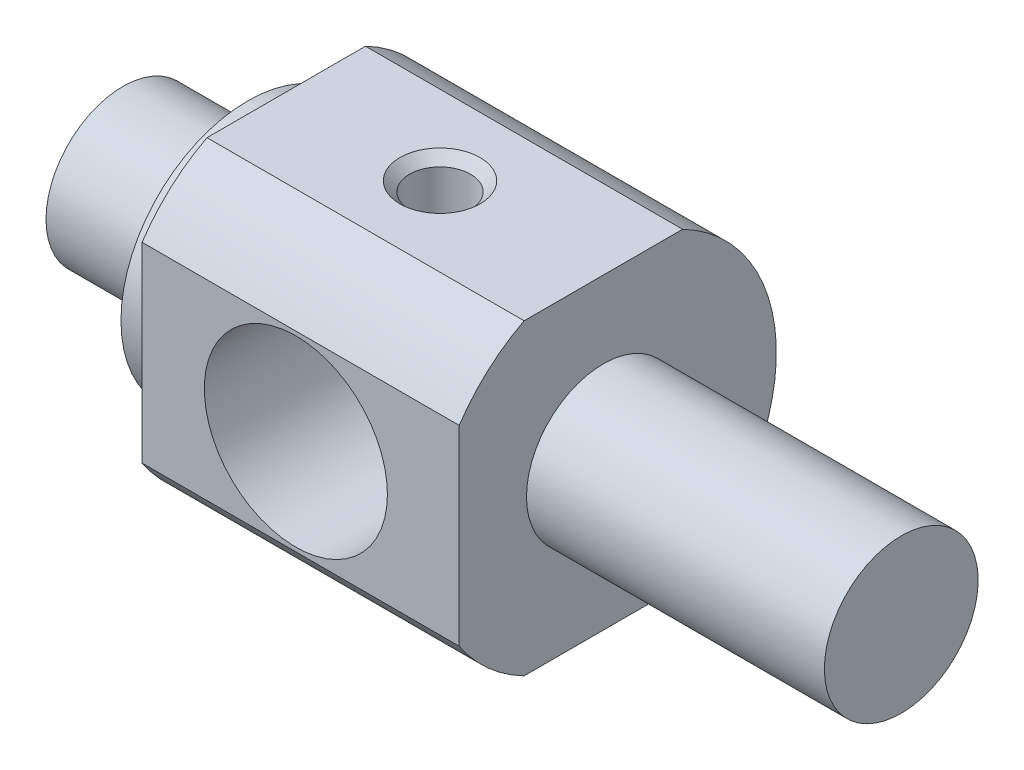
ISO-10303-21;
HEADER;
FILE_DESCRIPTION(('STEP AP214'),'2;1');
FILE_NAME('part.step','',(''),(''),'','','');
FILE_SCHEMA(('AUTOMOTIVE_DESIGN { 1 0 10303 214 1 1 1 1 }'));
ENDSEC;
DATA;
#1=APPLICATION_CONTEXT('core data for automotive mechanical design processes');
#2=APPLICATION_PROTOCOL_DEFINITION('international standard','automotive_design',2000,#1);
#3=PRODUCT_CONTEXT('',#1,'mechanical');
#4=PRODUCT('Part','Part','',(#3));
#5=PRODUCT_RELATED_PRODUCT_CATEGORY('part','',(#4));
#6=PRODUCT_DEFINITION_FORMATION('','',#4);
#7=PRODUCT_DEFINITION_CONTEXT('part definition',#1,'design');
#8=PRODUCT_DEFINITION('design','',#6,#7);
#9=PRODUCT_DEFINITION_SHAPE('','',#8);
#10=(LENGTH_UNIT() NAMED_UNIT(*) SI_UNIT(.MILLI.,.METRE.));
#11=(NAMED_UNIT(*) PLANE_ANGLE_UNIT() SI_UNIT($,.RADIAN.));
#12=(NAMED_UNIT(*) SI_UNIT($,.STERADIAN.) SOLID_ANGLE_UNIT());
#13=UNCERTAINTY_MEASURE_WITH_UNIT(LENGTH_MEASURE(1.E-05),#10,'distance_accuracy_value','');
#14=(GEOMETRIC_REPRESENTATION_CONTEXT(3) GLOBAL_UNCERTAINTY_ASSIGNED_CONTEXT((#13)) GLOBAL_UNIT_ASSIGNED_CONTEXT((#10,
#11,#12)) REPRESENTATION_CONTEXT('',''));
#15=CARTESIAN_POINT('',(0.,0.,0.));
#16=DIRECTION('',(0.,0.,1.));
#17=DIRECTION('',(1.,0.,0.));
#18=AXIS2_PLACEMENT_3D('',#15,#16,#17);
#19=CARTESIAN_POINT('',(-8.,0.,-0.75));
#20=DIRECTION('',(-1.,0.,0.));
#21=DIRECTION('',(0.,0.,1.));
#22=AXIS2_PLACEMENT_3D('',#19,#20,#21);
#23=PLANE('',#22);
#24=CARTESIAN_POINT('',(-8.,0.,0.));
#25=DIRECTION('',(-1.,0.,0.));
#26=DIRECTION('',(0.,0.,1.));
#27=AXIS2_PLACEMENT_3D('',#24,#25,#26);
#28=CIRCLE('',#27,6.6);
#29=CARTESIAN_POINT('',(-8.,0.,6.6));
#30=VERTEX_POINT('',#29);
#31=EDGE_CURVE('E264',#30,#30,#28,.T.);
#32=ORIENTED_EDGE('',*,*,#31,.F.);
#33=EDGE_LOOP('',(#32));
#34=FACE_BOUND('',#33,.T.);
#35=CARTESIAN_POINT('',(-8.,0.,0.));
#36=DIRECTION('',(-1.,0.,0.));
#37=DIRECTION('',(0.,0.,1.));
#38=AXIS2_PLACEMENT_3D('',#35,#36,#37);
#39=CIRCLE('',#38,9.);
#40=CARTESIAN_POINT('',(-8.,8.,-4.12310562561766));
#41=VERTEX_POINT('',#40);
#42=CARTESIAN_POINT('',(-8.,-8.,-4.12310562561766));
#43=VERTEX_POINT('',#42);
#44=EDGE_CURVE('E236',#41,#43,#39,.T.);
#45=ORIENTED_EDGE('',*,*,#44,.T.);
#46=DIRECTION('',(0.,0.,1.));
#47=VECTOR('',#46,1.);
#48=CARTESIAN_POINT('',(-8.,-8.,-0.75));
#49=LINE('',#48,#47);
#50=CARTESIAN_POINT('',(-8.,-8.,4.12310562561766));
#51=VERTEX_POINT('',#50);
#52=EDGE_CURVE('E61',#43,#51,#49,.T.);
#53=ORIENTED_EDGE('',*,*,#52,.T.);
#54=CARTESIAN_POINT('',(-8.,-4.9749371855331,7.5));
#55=VERTEX_POINT('',#54);
#56=EDGE_CURVE('E238',#51,#55,#39,.T.);
#57=ORIENTED_EDGE('',*,*,#56,.T.);
#58=DIRECTION('',(0.,-1.,0.));
#59=VECTOR('',#58,1.);
#60=CARTESIAN_POINT('',(-8.,0.,7.5));
#61=LINE('',#60,#59);
#62=CARTESIAN_POINT('',(-8.,4.9749371855331,7.5));
#63=VERTEX_POINT('',#62);
#64=EDGE_CURVE('E132',#63,#55,#61,.T.);
#65=ORIENTED_EDGE('',*,*,#64,.F.);
#66=CARTESIAN_POINT('',(-8.,8.,4.12310562561766));
#67=VERTEX_POINT('',#66);
#68=EDGE_CURVE('E231',#63,#67,#39,.T.);
#69=ORIENTED_EDGE('',*,*,#68,.T.);
#70=DIRECTION('',(0.,0.,-1.));
#71=VECTOR('',#70,1.);
#72=CARTESIAN_POINT('',(-8.,8.,-0.75));
#73=LINE('',#72,#71);
#74=EDGE_CURVE('E69',#67,#41,#73,.T.);
#75=ORIENTED_EDGE('',*,*,#74,.T.);
#76=EDGE_LOOP('',(#45,#53,#57,#65,#69,#75));
#77=FACE_BOUND('',#76,.T.);
#78=ADVANCED_FACE('F45',(#34,#77),#23,.T.);
#79=CARTESIAN_POINT('',(8.5,0.,-4.));
#80=DIRECTION('',(-1.,0.,0.));
#81=DIRECTION('',(0.,0.,1.));
#82=AXIS2_PLACEMENT_3D('',#79,#80,#81);
#83=PLANE('',#82);
#84=CARTESIAN_POINT('',(8.5,0.,0.));
#85=DIRECTION('',(-1.,0.,0.));
#86=DIRECTION('',(0.,0.,1.));
#87=AXIS2_PLACEMENT_3D('',#84,#85,#86);
#88=CIRCLE('',#87,4.);
#89=CARTESIAN_POINT('',(8.5,0.,4.));
#90=VERTEX_POINT('',#89);
#91=EDGE_CURVE('E122',#90,#90,#88,.T.);
#92=ORIENTED_EDGE('',*,*,#91,.T.);
#93=EDGE_LOOP('',(#92));
#94=FACE_BOUND('',#93,.T.);
#95=DIRECTION('',(0.,0.,1.));
#96=VECTOR('',#95,1.);
#97=CARTESIAN_POINT('',(8.5,-8.,-4.));
#98=LINE('',#97,#96);
#99=CARTESIAN_POINT('',(8.5,-8.,-4.12310562561766));
#100=VERTEX_POINT('',#99);
#101=CARTESIAN_POINT('',(8.5,-8.,4.12310562561766));
#102=VERTEX_POINT('',#101);
#103=EDGE_CURVE('E99',#100,#102,#98,.T.);
#104=ORIENTED_EDGE('',*,*,#103,.F.);
#105=CARTESIAN_POINT('',(8.5,0.,0.));
#106=DIRECTION('',(-1.,0.,0.));
#107=DIRECTION('',(0.,0.,1.));
#108=AXIS2_PLACEMENT_3D('',#105,#106,#107);
#109=CIRCLE('',#108,9.);
#110=CARTESIAN_POINT('',(8.5,8.,-4.12310562561766));
#111=VERTEX_POINT('',#110);
#112=EDGE_CURVE('E112',#111,#100,#109,.T.);
#113=ORIENTED_EDGE('',*,*,#112,.F.);
#114=DIRECTION('',(0.,0.,-1.));
#115=VECTOR('',#114,1.);
#116=CARTESIAN_POINT('',(8.5,8.,-4.));
#117=LINE('',#116,#115);
#118=CARTESIAN_POINT('',(8.5,8.,4.12310562561766));
#119=VERTEX_POINT('',#118);
#120=EDGE_CURVE('E289',#119,#111,#117,.T.);
#121=ORIENTED_EDGE('',*,*,#120,.F.);
#122=CARTESIAN_POINT('',(8.5,4.9749371855331,7.5));
#123=VERTEX_POINT('',#122);
#124=EDGE_CURVE('E119',#123,#119,#109,.T.);
#125=ORIENTED_EDGE('',*,*,#124,.F.);
#126=DIRECTION('',(0.,1.,0.));
#127=VECTOR('',#126,1.);
#128=CARTESIAN_POINT('',(8.5,0.,7.5));
#129=LINE('',#128,#127);
#130=CARTESIAN_POINT('',(8.5,-4.9749371855331,7.5));
#131=VERTEX_POINT('',#130);
#132=EDGE_CURVE('E243',#131,#123,#129,.T.);
#133=ORIENTED_EDGE('',*,*,#132,.F.);
#134=EDGE_CURVE('E114',#102,#131,#109,.T.);
#135=ORIENTED_EDGE('',*,*,#134,.F.);
#136=EDGE_LOOP('',(#104,#113,#121,#125,#133,#135));
#137=FACE_BOUND('',#136,.T.);
#138=ADVANCED_FACE('F110',(#94,#137),#83,.F.);
#139=CARTESIAN_POINT('',(-16.5,0.,0.));
#140=DIRECTION('',(-1.,0.,0.));
#141=DIRECTION('',(0.,0.,1.));
#142=AXIS2_PLACEMENT_3D('',#139,#140,#141);
#143=CYLINDRICAL_SURFACE('',#142,9.);
#144=DIRECTION('',(-1.,0.,0.));
#145=VECTOR('',#144,1.);
#146=CARTESIAN_POINT('',(-16.5,-8.,4.12310562561766));
#147=LINE('',#146,#145);
#148=EDGE_CURVE('E180',#102,#51,#147,.T.);
#149=ORIENTED_EDGE('',*,*,#148,.F.);
#150=ORIENTED_EDGE('',*,*,#134,.T.);
#151=DIRECTION('',(-1.,0.,0.));
#152=VECTOR('',#151,1.);
#153=CARTESIAN_POINT('',(-16.5,-4.9749371855331,7.5));
#154=LINE('',#153,#152);
#155=EDGE_CURVE('E233',#55,#131,#154,.F.);
#156=ORIENTED_EDGE('',*,*,#155,.F.);
#157=ORIENTED_EDGE('',*,*,#56,.F.);
#158=EDGE_LOOP('',(#149,#150,#156,#157));
#159=FACE_BOUND('',#158,.T.);
#160=ADVANCED_FACE('F207',(#159),#143,.T.);
#161=CARTESIAN_POINT('',(4.7625,0.,-9.));
#162=CARTESIAN_POINT('',(4.76250040344034,0.124347530609337,-9.00000033593268));
#163=CARTESIAN_POINT('',(4.75762497102388,0.248690209153137,-8.99741747917679));
#164=CARTESIAN_POINT('',(4.73818429685444,0.496448267490568,-8.98715281459778));
#165=CARTESIAN_POINT('',(4.72361561012522,0.619863301824312,-8.97946919396871));
#166=CARTESIAN_POINT('',(4.68494604518612,0.864923756681962,-8.95918759669115));
#167=CARTESIAN_POINT('',(4.66083414342587,0.98656696145733,-8.9465839370429));
#168=CARTESIAN_POINT('',(4.60335659926926,1.2271165949106,-8.91677535279601));
#169=CARTESIAN_POINT('',(4.56998717551858,1.34602188371177,-8.89956854808615));
#170=CARTESIAN_POINT('',(4.49453183223207,1.57974647578819,-8.86105868833504));
#171=CARTESIAN_POINT('',(4.45248572241949,1.69458172797125,-8.8397743723139));
#172=CARTESIAN_POINT('',(4.35999791893359,1.9200769121018,-8.79355324714562));
#173=CARTESIAN_POINT('',(4.30955305630161,2.03073524863851,-8.76861505977304));
#174=CARTESIAN_POINT('',(4.14631195388206,2.355441383801,-8.689154350124));
#175=CARTESIAN_POINT('',(4.02153101438027,2.56245973522728,-8.62994450585192));
#176=CARTESIAN_POINT('',(3.73450769966515,2.96653161712556,-8.49986717483721));
#177=CARTESIAN_POINT('',(3.57034891314541,3.16204774981258,-8.42849050207323));
#178=CARTESIAN_POINT('',(3.21341021284217,3.52422455016379,-8.28359383226396));
#179=CARTESIAN_POINT('',(3.02060591709596,3.69086037164852,-8.21007205265056));
#180=CARTESIAN_POINT('',(2.59104583087089,4.00559873450946,-8.06152102346557));
#181=CARTESIAN_POINT('',(2.35190146425856,4.15071118989951,-7.98694495512679));
#182=CARTESIAN_POINT('',(1.97456817015392,4.33614928006894,-7.88687285646168));
#183=CARTESIAN_POINT('',(1.84564222134866,4.39260344965641,-7.85547245236333));
#184=CARTESIAN_POINT('',(1.5823191366162,4.49416795346155,-7.79781135767696));
#185=CARTESIAN_POINT('',(1.44792547419633,4.5392853628367,-7.77154746372517));
#186=CARTESIAN_POINT('',(1.1830798050455,4.61514045974754,-7.72672647724666));
#187=CARTESIAN_POINT('',(1.05289599580195,4.64659346275591,-7.70779393806304));
#188=CARTESIAN_POINT('',(0.789657110491455,4.69849204058019,-7.67626849509927));
#189=CARTESIAN_POINT('',(0.65660369525027,4.71894381365446,-7.66367202174455));
#190=CARTESIAN_POINT('',(0.388873670643937,4.74850579482423,-7.64539058531394));
#191=CARTESIAN_POINT('',(0.254198429728474,4.75762496903582,-7.63970015840158));
#192=CARTESIAN_POINT('',(-0.0155431786148998,4.76438472807634,-7.63548662756686));
#193=CARTESIAN_POINT('',(-0.1506094981826,4.76202666269402,-7.63696268082556));
#194=CARTESIAN_POINT('',(-0.401152716936114,4.7469969845373,-7.64631160227324));
#195=CARTESIAN_POINT('',(-0.516754986564765,4.73579711408422,-7.65327138720916));
#196=CARTESIAN_POINT('',(-0.746443468906819,4.70506908950683,-7.67219908924904));
#197=CARTESIAN_POINT('',(-0.860529202601121,4.68553836552996,-7.68416855168734));
#198=CARTESIAN_POINT('',(-1.19933778505102,4.61477120774495,-7.72703163704495));
#199=CARTESIAN_POINT('',(-1.42076628999166,4.55135015439165,-7.76488652808671));
#200=CARTESIAN_POINT('',(-1.85436132832839,4.39287685995124,-7.85563852081105));
#201=CARTESIAN_POINT('',(-2.06620473013008,4.29714108141298,-7.9088567355142));
#202=CARTESIAN_POINT('',(-2.47192313766677,4.0772854937053,-8.02440970702211));
#203=CARTESIAN_POINT('',(-2.66579009227439,3.95315305196382,-8.08674851676314));
#204=CARTESIAN_POINT('',(-3.05943768140512,3.65923791181625,-8.22435127572942));
#205=CARTESIAN_POINT('',(-3.25603446809802,3.48545254953575,-8.30018223292903));
#206=CARTESIAN_POINT('',(-3.61878837512707,3.10715207855429,-8.44907339742118));
#207=CARTESIAN_POINT('',(-3.78492745789656,2.90261889011612,-8.52213194266733));
#208=CARTESIAN_POINT('',(-4.01229420738898,2.56951895440973,-8.62625299951984));
#209=CARTESIAN_POINT('',(-4.08610651228028,2.45048287630086,-8.66090273193149));
#210=CARTESIAN_POINT('',(-4.2233184790146,2.20559716317462,-8.72647541123955));
#211=CARTESIAN_POINT('',(-4.28672257017004,2.07975045695929,-8.75739994193113));
#212=CARTESIAN_POINT('',(-4.4024166722361,1.82210605452825,-8.81460949891191));
#213=CARTESIAN_POINT('',(-4.45471182057732,1.69031114345429,-8.84089666883255));
#214=CARTESIAN_POINT('',(-4.54756346992604,1.4217082325301,-8.88804394832803));
#215=CARTESIAN_POINT('',(-4.58812150455471,1.28490089025961,-8.90890476689695));
#216=CARTESIAN_POINT('',(-4.65385418760969,1.01980548149451,-8.94294338288788));
#217=CARTESIAN_POINT('',(-4.68007688556574,0.891843215793048,-8.9566398222332));
#218=CARTESIAN_POINT('',(-4.72195515273394,0.633744720642586,-8.97859314111829));
#219=CARTESIAN_POINT('',(-4.73761181149047,0.503608716762799,-8.98685058151237));
#220=CARTESIAN_POINT('',(-4.75813604512215,0.242311954478257,-8.99768728747259));
#221=CARTESIAN_POINT('',(-4.76300848266171,0.111151684704635,-9.00026911220135));
#222=CARTESIAN_POINT('',(-4.76190771489409,-0.15110703256956,-8.99968654248137));
#223=CARTESIAN_POINT('',(-4.75593511011223,-0.282205483091189,-8.99652246620188));
#224=CARTESIAN_POINT('',(-4.73424855064391,-0.531535942882391,-8.98507811945353));
#225=CARTESIAN_POINT('',(-4.71945222443262,-0.649871386958457,-8.97728000824626));
#226=CARTESIAN_POINT('',(-4.68110736184933,-0.884763575078478,-8.95718110814576));
#227=CARTESIAN_POINT('',(-4.65755608471691,-1.00131975020947,-8.9448789092543));
#228=CARTESIAN_POINT('',(-4.60196425659837,-1.23181886042372,-8.91605869083801));
#229=CARTESIAN_POINT('',(-4.56992636841199,-1.34576260303282,-8.89954199373392));
#230=CARTESIAN_POINT('',(-4.49768482213555,-1.57040822753636,-8.86266360437937));
#231=CARTESIAN_POINT('',(-4.45747801634521,-1.68110884089638,-8.84230043019264));
#232=CARTESIAN_POINT('',(-4.32291680123585,-2.01285493333985,-8.77496475562326));
#233=CARTESIAN_POINT('',(-4.21600277364841,-2.22784676260846,-8.72248545363852));
#234=CARTESIAN_POINT('',(-3.97273258849654,-2.63736014731493,-8.60753941243389));
#235=CARTESIAN_POINT('',(-3.83636477814371,-2.83187355544841,-8.54506872287111));
#236=CARTESIAN_POINT('',(-3.52137960502942,-3.21708140633032,-8.40811866059607));
#237=CARTESIAN_POINT('',(-3.33980863724168,-3.40516035248391,-8.33306899481405));
#238=CARTESIAN_POINT('',(-2.94791523306578,-3.74956909780719,-8.18388734030329));
#239=CARTESIAN_POINT('',(-2.73756728995106,-3.90587042157548,-8.10975623003755));
#240=CARTESIAN_POINT('',(-2.39626688930486,-4.11811375214691,-8.00299868949882));
#241=CARTESIAN_POINT('',(-2.27410215022463,-4.18683953100871,-7.96715458296367));
#242=CARTESIAN_POINT('',(-2.02336685114954,-4.31359488157598,-7.89924434073457));
#243=CARTESIAN_POINT('',(-1.8947994215147,-4.37162961630491,-7.86717638413926));
#244=CARTESIAN_POINT('',(-1.6321305650715,-4.47633002878034,-7.80807832339694));
#245=CARTESIAN_POINT('',(-1.49803418007951,-4.52300580779348,-7.7810437482403));
#246=CARTESIAN_POINT('',(-1.22518750903089,-4.6044083186877,-7.73315334237041));
#247=CARTESIAN_POINT('',(-1.08643804422795,-4.6391371471125,-7.71229642764267));
#248=CARTESIAN_POINT('',(-0.819273916993452,-4.69328392273565,-7.67945226514975));
#249=CARTESIAN_POINT('',(-0.691177302945137,-4.71386794672929,-7.66679657998025));
#250=CARTESIAN_POINT('',(-0.433271103101365,-4.74452730742417,-7.64786173290068));
#251=CARTESIAN_POINT('',(-0.303461750092644,-4.75460405762069,-7.64158171330458));
#252=CARTESIAN_POINT('',(-0.0433694510382342,-4.76407931361045,-7.63567808280728));
#253=CARTESIAN_POINT('',(0.0869132157401269,-4.76348333250254,-7.63605103525096));
#254=CARTESIAN_POINT('',(0.34679655585983,-4.75163730961809,-7.64342798657303));
#255=CARTESIAN_POINT('',(0.476397271138804,-4.74038793087339,-7.65043157278294));
#256=CARTESIAN_POINT('',(0.718496074448173,-4.70937876393872,-7.66955263472613));
#257=CARTESIAN_POINT('',(0.83120151623908,-4.69078495106566,-7.6809660561983));
#258=CARTESIAN_POINT('',(1.05447229830989,-4.64569507486617,-7.70832050051003));
#259=CARTESIAN_POINT('',(1.16503697948606,-4.61919661777295,-7.72426289479052));
#260=CARTESIAN_POINT('',(1.49251447862105,-4.52825029307427,-7.77817276738403));
#261=CARTESIAN_POINT('',(1.70535271444985,-4.45233287959253,-7.82223512012185));
#262=CARTESIAN_POINT('',(2.12915698663366,-4.26674886059048,-7.92507095583544));
#263=CARTESIAN_POINT('',(2.33910172027825,-4.15520901106104,-7.98461461078299));
#264=CARTESIAN_POINT('',(2.73873560413043,-3.9034008640743,-8.11068926544477));
#265=CARTESIAN_POINT('',(2.92841376260295,-3.76311709625537,-8.17722401842726));
#266=CARTESIAN_POINT('',(3.3100914927705,-3.43464615735664,-8.32104145757807));
#267=CARTESIAN_POINT('',(3.49861356527532,-3.24248814667078,-8.3985115102675));
#268=CARTESIAN_POINT('',(3.84182536349103,-2.82740321822199,-8.54717875720498));
#269=CARTESIAN_POINT('',(3.99649372834455,-2.60445701771309,-8.61837197410443));
#270=CARTESIAN_POINT('',(4.20079827858228,-2.24812566848557,-8.71559793731253));
#271=CARTESIAN_POINT('',(4.26483700274428,-2.12418324985102,-8.74670425907457));
#272=CARTESIAN_POINT('',(4.38210340700569,-1.87031879401267,-8.80447671148234));
#273=CARTESIAN_POINT('',(4.43533641009264,-1.74039973982838,-8.83114502715428));
#274=CARTESIAN_POINT('',(4.53025646437553,-1.47577336946772,-8.87919744770186));
#275=CARTESIAN_POINT('',(4.57196701465996,-1.34107644039356,-8.90059229762171));
#276=CARTESIAN_POINT('',(4.64339305083211,-1.06781622605154,-8.93749157200341));
#277=CARTESIAN_POINT('',(4.673115276126,-0.92925516003718,-8.95299930570159));
#278=CARTESIAN_POINT('',(4.71847947813409,-0.659351879404655,-8.97676434810901));
#279=CARTESIAN_POINT('',(4.73496634992829,-0.528189374616844,-8.98545571626096));
#280=CARTESIAN_POINT('',(4.75697648476616,-0.26468276068211,-8.99707341002876));
#281=CARTESIAN_POINT('',(4.76249957063286,-0.132338632474631,-8.99999964247885));
#282=CARTESIAN_POINT('',(4.7625,0.,-9.));
#283=B_SPLINE_CURVE_WITH_KNOTS('',3,(#161,#162,#163,#164,#165,#166,#167,#168,#169,#170,#171,
#172,#173,#174,#175,#176,#177,#178,#179,#180,#181,#182,#183,#184,#185,#186,#187,#188,#189,#190,
#191,#192,#193,#194,#195,#196,#197,#198,#199,#200,#201,#202,#203,#204,#205,#206,#207,#208,#209,
#210,#211,#212,#213,#214,#215,#216,#217,#218,#219,#220,#221,#222,#223,#224,#225,#226,#227,#228,
#229,#230,#231,#232,#233,#234,#235,#236,#237,#238,#239,#240,#241,#242,#243,#244,#245,#246,#247,
#248,#249,#250,#251,#252,#253,#254,#255,#256,#257,#258,#259,#260,#261,#262,#263,#264,#265,#266,
#267,#268,#269,#270,#271,#272,#273,#274,#275,#276,#277,#278,#279,#280,#281,#282),.UNSPECIFIED.,
.T.,.F.,(4,2,2,2,2,2,2,2,2,2,2,2,2,2,2,2,2,2,2,2,2,2,2,2,2,2,2,2,2,2,2,2,2,2,2,2,2,2,2,2,2,2,2,
2,2,2,2,2,2,2,2,2,2,2,2,2,2,2,2,2,4),(0.,0.372912735375715,0.745958074537272,1.11943558906099,
1.49306588047298,1.86501857493255,2.23711193135867,2.98054173945517,3.77259683168748,
4.56532999470477,5.42895642000663,5.86105348503776,6.29288020910701,6.69807088525076,
7.10303303112271,7.50767457497925,7.91226853183547,8.26089695162553,8.60963299211596,
9.30664673976379,10.0194388201854,10.7325486128775,11.5485658366515,12.365064769404,
12.7974337802674,13.2296183127742,13.6616025404303,14.0935302976789,14.4870065185386,
14.8804421588801,15.2737003607644,15.666936787325,16.0250536553686,16.3832827273805,
16.7413995325868,17.0996545922854,17.8336908431551,18.5680180341853,19.3805925575267,
20.1938920370063,20.6274443207353,21.0607866771151,21.4937422519301,21.9266218095311,
22.3171226184695,22.7075708883476,23.097817474352,23.4880397743099,23.8320373095211,
24.1761391235887,24.8639166558257,25.5964082992801,26.3292952200101,27.1660025255825,
28.0032362606288,28.431539090943,28.8596304209725,29.2868421381476,29.7138133563692,
30.1106846387448,30.5075623345878),.UNSPECIFIED.);
#284=CARTESIAN_POINT('',(4.7625,0.,-9.));
#285=VERTEX_POINT('',#284);
#286=EDGE_CURVE('E144',#285,#285,#283,.T.);
#287=ORIENTED_EDGE('',*,*,#286,.T.);
#288=EDGE_LOOP('',(#287));
#289=FACE_BOUND('',#288,.T.);
#290=DIRECTION('',(-1.,0.,0.));
#291=VECTOR('',#290,1.);
#292=CARTESIAN_POINT('',(-16.5,-8.,-4.12310562561766));
#293=LINE('',#292,#291);
#294=EDGE_CURVE('E96',#43,#100,#293,.F.);
#295=ORIENTED_EDGE('',*,*,#294,.F.);
#296=ORIENTED_EDGE('',*,*,#44,.F.);
#297=DIRECTION('',(-1.,0.,0.));
#298=VECTOR('',#297,1.);
#299=CARTESIAN_POINT('',(-16.5,8.,-4.12310562561766));
#300=LINE('',#299,#298);
#301=EDGE_CURVE('E118',#111,#41,#300,.T.);
#302=ORIENTED_EDGE('',*,*,#301,.F.);
#303=ORIENTED_EDGE('',*,*,#112,.T.);
#304=EDGE_LOOP('',(#295,#296,#302,#303));
#305=FACE_BOUND('',#304,.T.);
#306=ADVANCED_FACE('F117',(#289,#305),#143,.T.);
#307=CARTESIAN_POINT('',(0.,8.,0.));
#308=DIRECTION('',(0.,1.,0.));
#309=DIRECTION('',(0.,0.,1.));
#310=AXIS2_PLACEMENT_3D('',#307,#308,#309);
#311=CYLINDRICAL_SURFACE('',#310,1.5875);
#312=CARTESIAN_POINT('',(0.,-4.7625,1.5875));
#313=CARTESIAN_POINT('',(-0.0866193385826729,-4.76250024290248,1.58750040279898));
#314=CARTESIAN_POINT('',(-0.173236246329948,-4.76011509093227,1.58038757752304));
#315=CARTESIAN_POINT('',(-0.343918795385843,-4.75083521197708,1.55221128975266));
#316=CARTESIAN_POINT('',(-0.427984170888622,-4.74394001683417,1.53114637898108));
#317=CARTESIAN_POINT('',(-0.591078303334068,-4.72638926301477,1.47586820112782));
#318=CARTESIAN_POINT('',(-0.670115223594078,-4.71573999272729,1.4416769133459));
#319=CARTESIAN_POINT('',(-0.821332712178451,-4.6917680757628,1.36121588811912));
#320=CARTESIAN_POINT('',(-0.893511924171944,-4.67844490185097,1.31494376805837));
#321=CARTESIAN_POINT('',(-1.03146490909785,-4.6500112492827,1.20995153478673));
#322=CARTESIAN_POINT('',(-1.09696837422356,-4.63485795886258,1.15088791561146));
#323=CARTESIAN_POINT('',(-1.21734689966456,-4.60470749718205,1.02271964190332));
#324=CARTESIAN_POINT('',(-1.27221961946452,-4.58971036098746,0.953612782050985));
#325=CARTESIAN_POINT('',(-1.37132209578672,-4.56109915307672,0.804886129625619));
#326=CARTESIAN_POINT('',(-1.41520046242589,-4.54753724850155,0.725021188175255));
#327=CARTESIAN_POINT('',(-1.48878746228088,-4.52398297352029,0.558520450047056));
#328=CARTESIAN_POINT('',(-1.51850041960149,-4.51398951405183,0.471886729004144));
#329=CARTESIAN_POINT('',(-1.56189912014579,-4.49915443940136,0.297381260873972));
#330=CARTESIAN_POINT('',(-1.57609134913143,-4.49415052034258,0.20964968152361));
#331=CARTESIAN_POINT('',(-1.58962903329348,-4.48938104899343,0.0329187902775394));
#332=CARTESIAN_POINT('',(-1.58897907629749,-4.48961387798584,-0.0560801213758395));
#333=CARTESIAN_POINT('',(-1.57324409712917,-4.49514936325486,-0.228499400829883));
#334=CARTESIAN_POINT('',(-1.5588200871526,-4.50021985189708,-0.311988839633941));
#335=CARTESIAN_POINT('',(-1.51702478352345,-4.51447944137724,-0.475287053625849));
#336=CARTESIAN_POINT('',(-1.48965193971459,-4.52366903532271,-0.555095386878173));
#337=CARTESIAN_POINT('',(-1.42230325467058,-4.54529683920857,-0.710267739976471));
#338=CARTESIAN_POINT('',(-1.38213155232278,-4.55778498196574,-0.785539490432871));
#339=CARTESIAN_POINT('',(-1.29046145625623,-4.58458186738965,-0.928482566894064));
#340=CARTESIAN_POINT('',(-1.23895979087786,-4.59889113542361,-0.996151689006741));
#341=CARTESIAN_POINT('',(-1.12291706563305,-4.62863135053788,-1.12568291208022));
#342=CARTESIAN_POINT('',(-1.05783562574614,-4.64408185600813,-1.18705740253315));
#343=CARTESIAN_POINT('',(-0.918114067327474,-4.67371014689421,-1.29814838582814));
#344=CARTESIAN_POINT('',(-0.843473033111541,-4.68788781016682,-1.34786376058613));
#345=CARTESIAN_POINT('',(-0.685716835710948,-4.71355908851247,-1.43461787662317));
#346=CARTESIAN_POINT('',(-0.602524951310933,-4.72502468137762,-1.47152596750341));
#347=CARTESIAN_POINT('',(-0.430639669841155,-4.7437765034179,-1.53067253865469));
#348=CARTESIAN_POINT('',(-0.341948195570988,-4.7510641842712,-1.5529161147347));
#349=CARTESIAN_POINT('',(-0.16570932937777,-4.76039857975911,-1.58123836981049));
#350=CARTESIAN_POINT('',(-0.078278989785443,-4.76265877911043,-1.58797594706174));
#351=CARTESIAN_POINT('',(0.0964804235618768,-4.76232383028038,-1.58697188066243));
#352=CARTESIAN_POINT('',(0.183809511919945,-4.75972950165737,-1.57923268103194));
#353=CARTESIAN_POINT('',(0.353250287758005,-4.75011789238403,-1.55001609646916));
#354=CARTESIAN_POINT('',(0.435439830850313,-4.74323090454018,-1.52894314789643));
#355=CARTESIAN_POINT('',(0.595083834245072,-4.72585806842736,-1.47416290690907));
#356=CARTESIAN_POINT('',(0.672537689257411,-4.71537176124096,-1.44045400334489));
#357=CARTESIAN_POINT('',(0.82278267052432,-4.69152178418572,-1.36037568945275));
#358=CARTESIAN_POINT('',(0.895397560257219,-4.6780896842481,-1.31369658316296));
#359=CARTESIAN_POINT('',(1.03197791784024,-4.64987090592066,-1.20936678685359));
#360=CARTESIAN_POINT('',(1.09594073387548,-4.63508381455201,-1.15171274604957));
#361=CARTESIAN_POINT('',(1.2164258561425,-4.60496996168956,-1.02397123277704));
#362=CARTESIAN_POINT('',(1.27247803867766,-4.58964920726292,-0.953437852253606));
#363=CARTESIAN_POINT('',(1.37200881668867,-4.5608870760535,-0.803637636100214));
#364=CARTESIAN_POINT('',(1.41548730734048,-4.54744571493928,-0.724370727668402));
#365=CARTESIAN_POINT('',(1.48843512703597,-4.52409546968821,-0.559319088227289));
#366=CARTESIAN_POINT('',(1.51793278481197,-4.51417945258854,-0.473547949319583));
#367=CARTESIAN_POINT('',(1.56193278348047,-4.49914696286488,-0.297848893054942));
#368=CARTESIAN_POINT('',(1.57644187973938,-4.49402832815027,-0.207922867420594));
#369=CARTESIAN_POINT('',(1.58952609843278,-4.48941600962756,-0.0314371100350451));
#370=CARTESIAN_POINT('',(1.58888153347708,-4.48964685408646,0.055058215205332));
#371=CARTESIAN_POINT('',(1.5735971408498,-4.49502640845389,0.226639556438774));
#372=CARTESIAN_POINT('',(1.5589581461405,-4.50017482566361,0.311725656003703));
#373=CARTESIAN_POINT('',(1.51665275334283,-4.51460432334015,0.476465365016424));
#374=CARTESIAN_POINT('',(1.48923906179963,-4.52380505610683,0.556191459694638));
#375=CARTESIAN_POINT('',(1.42236724314359,-4.54527283124319,0.709973508514501));
#376=CARTESIAN_POINT('',(1.38290644257916,-4.55754055411886,0.78402819951096));
#377=CARTESIAN_POINT('',(1.29105134947619,-4.58442741396348,0.92786782600262));
#378=CARTESIAN_POINT('',(1.23816783538877,-4.59912579731892,0.997325446763686));
#379=CARTESIAN_POINT('',(1.12179557697784,-4.62888578099664,1.12663257874742));
#380=CARTESIAN_POINT('',(1.05830383406672,-4.64394748298391,1.18647936390482));
#381=CARTESIAN_POINT('',(0.91954597161159,-4.67344173459301,1.29721675450907));
#382=CARTESIAN_POINT('',(0.843917402680817,-4.68782688609495,1.34766740205471));
#383=CARTESIAN_POINT('',(0.684779804883015,-4.71370010986521,1.4350848058004));
#384=CARTESIAN_POINT('',(0.601272797535102,-4.72518892253838,1.47205500915124));
#385=CARTESIAN_POINT('',(0.432583664931548,-4.7435375517131,1.52990809157576));
#386=CARTESIAN_POINT('',(0.347643065311298,-4.75058124720754,1.55143591519311));
#387=CARTESIAN_POINT('',(0.175133660416267,-4.76006171214452,1.58022969557493));
#388=CARTESIAN_POINT('',(0.0875655880903847,-4.76249975444399,1.58749959280075));
#389=CARTESIAN_POINT('',(0.,-4.7625,1.5875));
#390=B_SPLINE_CURVE_WITH_KNOTS('',3,(#312,#313,#314,#315,#316,#317,#318,#319,#320,#321,#322,
#323,#324,#325,#326,#327,#328,#329,#330,#331,#332,#333,#334,#335,#336,#337,#338,#339,#340,#341,
#342,#343,#344,#345,#346,#347,#348,#349,#350,#351,#352,#353,#354,#355,#356,#357,#358,#359,#360,
#361,#362,#363,#364,#365,#366,#367,#368,#369,#370,#371,#372,#373,#374,#375,#376,#377,#378,#379,
#380,#381,#382,#383,#384,#385,#386,#387,#388,#389),.UNSPECIFIED.,.T.,.F.,(4,2,2,2,2,2,2,2,2,2,2,
2,2,2,2,2,2,2,2,2,2,2,2,2,2,2,2,2,2,2,2,2,2,2,2,2,2,2,4),(0.,0.259535780816292,
0.519098506612188,0.778228493181558,1.03740962475607,1.30468186298875,1.57201287843954,
1.84703060907259,2.12196433449872,2.38763057115171,2.65321468955133,2.90666212150157,
3.16013990233077,3.41769971708769,3.67533400311153,3.94641872975544,4.21752944222006,
4.49132968969942,4.76503474342567,5.02687563290581,5.28867232148129,5.54288575790413,
5.79713161888514,6.05806509751931,6.31907837054751,6.59195123823192,6.86482638073056,
7.13714621949997,7.4093432697052,7.66755619877009,7.92575375970307,8.17904744490161,
8.43239738104363,8.69680230873238,8.96128210158997,9.2360696157572,9.51078681329523,
9.77323036418427,10.0356013733555),.UNSPECIFIED.);
#391=CARTESIAN_POINT('',(0.,-4.7625,1.5875));
#392=VERTEX_POINT('',#391);
#393=EDGE_CURVE('E179',#392,#392,#390,.T.);
#394=ORIENTED_EDGE('',*,*,#393,.F.);
#395=EDGE_LOOP('',(#394));
#396=FACE_BOUND('',#395,.T.);
#397=CARTESIAN_POINT('',(0.,-8.,0.));
#398=DIRECTION('',(0.,-1.,0.));
#399=DIRECTION('',(0.,0.,-1.));
#400=AXIS2_PLACEMENT_3D('',#397,#398,#399);
#401=CIRCLE('',#400,1.5875);
#402=CARTESIAN_POINT('',(0.,-8.,-1.5875));
#403=VERTEX_POINT('',#402);
#404=EDGE_CURVE('E105',#403,#403,#401,.F.);
#405=ORIENTED_EDGE('',*,*,#404,.F.);
#406=EDGE_LOOP('',(#405));
#407=FACE_BOUND('',#406,.T.);
#408=ADVANCED_FACE('F185',(#396,#407),#311,.F.);
#409=DIRECTION('',(-1.,0.,0.));
#410=VECTOR('',#409,1.);
#411=CARTESIAN_POINT('',(-16.5,8.,4.12310562561766));
#412=LINE('',#411,#410);
#413=EDGE_CURVE('E135',#67,#119,#412,.F.);
#414=ORIENTED_EDGE('',*,*,#413,.F.);
#415=ORIENTED_EDGE('',*,*,#68,.F.);
#416=DIRECTION('',(-1.,0.,0.));
#417=VECTOR('',#416,1.);
#418=CARTESIAN_POINT('',(-16.5,4.9749371855331,7.5));
#419=LINE('',#418,#417);
#420=EDGE_CURVE('E245',#123,#63,#419,.T.);
#421=ORIENTED_EDGE('',*,*,#420,.F.);
#422=ORIENTED_EDGE('',*,*,#124,.T.);
#423=EDGE_LOOP('',(#414,#415,#421,#422));
#424=FACE_BOUND('',#423,.T.);
#425=ADVANCED_FACE('F189',(#424),#143,.T.);
#426=CARTESIAN_POINT('',(-10.,0.,-9.));
#427=DIRECTION('',(1.,0.,0.));
#428=DIRECTION('',(0.,0.,-1.));
#429=AXIS2_PLACEMENT_3D('',#426,#427,#428);
#430=PLANE('',#429);
#431=CARTESIAN_POINT('',(-10.,0.,0.));
#432=DIRECTION('',(-1.,0.,0.));
#433=DIRECTION('',(0.,0.,1.));
#434=AXIS2_PLACEMENT_3D('',#431,#432,#433);
#435=CIRCLE('',#434,4.);
#436=CARTESIAN_POINT('',(-10.,0.,4.));
#437=VERTEX_POINT('',#436);
#438=EDGE_CURVE('E123',#437,#437,#435,.T.);
#439=ORIENTED_EDGE('',*,*,#438,.F.);
#440=EDGE_LOOP('',(#439));
#441=FACE_BOUND('',#440,.T.);
#442=CARTESIAN_POINT('',(-10.,0.,0.));
#443=DIRECTION('',(-1.,0.,0.));
#444=DIRECTION('',(0.,0.,1.));
#445=AXIS2_PLACEMENT_3D('',#442,#443,#444);
#446=CIRCLE('',#445,6.6);
#447=CARTESIAN_POINT('',(-10.,0.,6.6));
#448=VERTEX_POINT('',#447);
#449=EDGE_CURVE('E262',#448,#448,#446,.T.);
#450=ORIENTED_EDGE('',*,*,#449,.T.);
#451=EDGE_LOOP('',(#450));
#452=FACE_BOUND('',#451,.T.);
#453=ADVANCED_FACE('F255',(#441,#452),#430,.F.);
#454=CARTESIAN_POINT('',(-16.5,0.,-4.));
#455=DIRECTION('',(1.,0.,0.));
#456=DIRECTION('',(0.,0.,-1.));
#457=AXIS2_PLACEMENT_3D('',#454,#455,#456);
#458=PLANE('',#457);
#459=CARTESIAN_POINT('',(-16.5,0.,0.));
#460=DIRECTION('',(-1.,0.,0.));
#461=DIRECTION('',(0.,0.,1.));
#462=AXIS2_PLACEMENT_3D('',#459,#460,#461);
#463=CIRCLE('',#462,4.);
#464=CARTESIAN_POINT('',(-16.5,0.,4.));
#465=VERTEX_POINT('',#464);
#466=EDGE_CURVE('E247',#465,#465,#463,.T.);
#467=ORIENTED_EDGE('',*,*,#466,.T.);
#468=EDGE_LOOP('',(#467));
#469=FACE_BOUND('',#468,.T.);
#470=CARTESIAN_POINT('',(-16.5,0.,0.));
#471=DIRECTION('',(-1.,0.,0.));
#472=DIRECTION('',(0.,0.,1.));
#473=AXIS2_PLACEMENT_3D('',#470,#471,#472);
#474=CIRCLE('',#473,1.7272);
#475=CARTESIAN_POINT('',(-16.5,0.,1.7272));
#476=VERTEX_POINT('',#475);
#477=EDGE_CURVE('E229',#476,#476,#474,.T.);
#478=ORIENTED_EDGE('',*,*,#477,.F.);
#479=EDGE_LOOP('',(#478));
#480=FACE_BOUND('',#479,.T.);
#481=ADVANCED_FACE('F258',(#469,#480),#458,.F.);
#482=CARTESIAN_POINT('',(-16.5,0.,0.));
#483=DIRECTION('',(-1.,0.,0.));
#484=DIRECTION('',(0.,0.,1.));
#485=AXIS2_PLACEMENT_3D('',#482,#483,#484);
#486=CYLINDRICAL_SURFACE('',#485,4.);
#487=ORIENTED_EDGE('',*,*,#466,.F.);
#488=EDGE_LOOP('',(#487));
#489=FACE_BOUND('',#488,.T.);
#490=ORIENTED_EDGE('',*,*,#438,.T.);
#491=EDGE_LOOP('',(#490));
#492=FACE_BOUND('',#491,.T.);
#493=ADVANCED_FACE('F221',(#489,#492),#486,.T.);
#494=CARTESIAN_POINT('',(-5.79,0.,0.));
#495=DIRECTION('',(-1.,0.,0.));
#496=DIRECTION('',(0.,0.,1.));
#497=AXIS2_PLACEMENT_3D('',#494,#495,#496);
#498=CONICAL_SURFACE('',#497,1.7272,1.02974425867665);
#499=CARTESIAN_POINT('',(-4.76247741693726,-0.0146663957069357,-0.00882204789461912));
#500=CARTESIAN_POINT('',(-4.76247893900563,-0.0141721546465493,-0.0096485411905238));
#501=CARTESIAN_POINT('',(-4.76248060048711,-0.0136078396637135,-0.0104339415549042));
#502=CARTESIAN_POINT('',(-4.76248401567558,-0.0123548422312533,-0.01189945859676));
#503=CARTESIAN_POINT('',(-4.76248576948931,-0.0116660135121903,-0.0125794496832752));
#504=CARTESIAN_POINT('',(-4.76248916851895,-0.0101841659526936,-0.013813507319612));
#505=CARTESIAN_POINT('',(-4.76249081380425,-0.00939121465357078,-0.0143676548698818));
#506=CARTESIAN_POINT('',(-4.7624938101049,-0.0077235244550204,-0.0153343510418347));
#507=CARTESIAN_POINT('',(-4.76249516119518,-0.00684880645985682,-0.0157469357298197));
#508=CARTESIAN_POINT('',(-4.7624974131353,-0.0050448462056021,-0.016417824978434));
#509=CARTESIAN_POINT('',(-4.76249831522537,-0.00411576215120478,-0.0166765549089864));
#510=CARTESIAN_POINT('',(-4.76249957274606,-0.0022272765334139,-0.0170340260718423));
#511=CARTESIAN_POINT('',(-4.76249992816342,-0.00126787423428479,-0.0171327634185472));
#512=CARTESIAN_POINT('',(-4.7625000519226,0.000651944915263623,-0.0171673376162856));
#513=CARTESIAN_POINT('',(-4.7624998214304,0.00161235595480908,-0.0171034979989839));
#514=CARTESIAN_POINT('',(-4.76249880185758,0.00350881207781196,-0.0168154495868988));
#515=CARTESIAN_POINT('',(-4.76249801278016,0.00444485730030172,-0.0165912417073912));
#516=CARTESIAN_POINT('',(-4.76249596517724,0.00626587913497903,-0.0159889846263463));
#517=CARTESIAN_POINT('',(-4.76249470673509,0.00715086478105571,-0.0156109627347699));
#518=CARTESIAN_POINT('',(-4.76249186195406,0.00884495628245117,-0.014711950625154));
#519=CARTESIAN_POINT('',(-4.76249027561357,0.00965406176336549,-0.0141909597017329));
#520=CARTESIAN_POINT('',(-4.76248695022384,0.0111749393347839,-0.0130199237207816));
#521=CARTESIAN_POINT('',(-4.76248521092133,0.0118865448097564,-0.0123696622899185));
#522=CARTESIAN_POINT('',(-4.76248177714245,0.0131908612733591,-0.0109591976983726));
#523=CARTESIAN_POINT('',(-4.76248008266677,0.0137835704440058,-0.0101989928569063));
#524=CARTESIAN_POINT('',(-4.76247692379654,0.0148350431651258,-0.00858795175563163));
#525=CARTESIAN_POINT('',(-4.76247546005911,0.0152934272518246,-0.00773686783309376));
#526=CARTESIAN_POINT('',(-4.76247293268833,0.0160612454300078,-0.00596997329553233));
#527=CARTESIAN_POINT('',(-4.76247186906106,0.0163706772577205,-0.00505416169702221));
#528=CARTESIAN_POINT('',(-4.76247025890992,0.01683261821569,-0.00318117116363141));
#529=CARTESIAN_POINT('',(-4.76246971377969,0.016984704518948,-0.00222388793012703));
#530=CARTESIAN_POINT('',(-4.76246920688487,0.0171262557524921,-0.0002973689579155));
#531=CARTESIAN_POINT('',(-4.76246924512633,0.0171157189945377,0.000671866904771235));
#532=CARTESIAN_POINT('',(-4.76246990115427,0.016932183793323,0.00259621432643375));
#533=CARTESIAN_POINT('',(-4.76247051975417,0.0167589573267274,0.00355130414971717));
#534=CARTESIAN_POINT('',(-4.76247226792642,0.0162545461633495,0.00541882604423561));
#535=CARTESIAN_POINT('',(-4.76247339749896,0.0159233614044532,0.00633125809869614));
#536=CARTESIAN_POINT('',(-4.76247603940462,0.015112496372441,0.00808704499746114));
#537=CARTESIAN_POINT('',(-4.76247755155522,0.0146328868823628,0.00893043252684459));
#538=CARTESIAN_POINT('',(-4.76248078786692,0.0135385929049311,0.0105244883118042));
#539=CARTESIAN_POINT('',(-4.76248251202596,0.0129239097311078,0.0112751574689134));
#540=CARTESIAN_POINT('',(-4.76248597307714,0.0115782907895385,0.012660691363402));
#541=CARTESIAN_POINT('',(-4.76248770993379,0.0108476086826778,0.0132958024400969));
#542=CARTESIAN_POINT('',(-4.76249100331468,0.00928972391042185,0.0144339100930538));
#543=CARTESIAN_POINT('',(-4.76249255984181,0.00846252278507018,0.0149369087768658));
#544=CARTESIAN_POINT('',(-4.76249531177318,0.00673766198494864,0.0157949712116569));
#545=CARTESIAN_POINT('',(-4.76249650821444,0.00584021420759853,0.0161504609207097));
#546=CARTESIAN_POINT('',(-4.76249841062176,0.00399828895888867,0.0167053191422518));
#547=CARTESIAN_POINT('',(-4.76249911659491,0.00305381216600191,0.0169046899063269));
#548=CARTESIAN_POINT('',(-4.76249995704146,0.00114704953543944,0.0171412431671504));
#549=CARTESIAN_POINT('',(-4.76250009287022,0.000184811400898977,0.0171788103092539));
#550=CARTESIAN_POINT('',(-4.76249978142428,-0.00173228985603394,0.0170917240175059));
#551=CARTESIAN_POINT('',(-4.76249933415439,-0.00268715303904981,0.016967071918556));
#552=CARTESIAN_POINT('',(-4.76249790758729,-0.00456162709878997,0.016559317941687));
#553=CARTESIAN_POINT('',(-4.76249692871015,-0.00548126519668571,0.0162763411654074));
#554=CARTESIAN_POINT('',(-4.76249454942716,-0.00726006172316784,0.0155601827980505));
#555=CARTESIAN_POINT('',(-4.76249314901909,-0.00811921983186132,0.0151270004125721));
#556=CARTESIAN_POINT('',(-4.76249008224985,-0.0097537779584039,0.0141222817154135));
#557=CARTESIAN_POINT('',(-4.76248841558483,-0.0105290805637865,0.013550586942619));
#558=CARTESIAN_POINT('',(-4.76248500462497,-0.0119730148336966,0.0122854561343078));
#559=CARTESIAN_POINT('',(-4.762483260329,-0.0126416449447001,0.011592018326096));
#560=CARTESIAN_POINT('',(-4.76247988506992,-0.0138551248370111,0.0101011870741858));
#561=CARTESIAN_POINT('',(-4.76247825441212,-0.0143996494705127,0.00930352898063483));
#562=CARTESIAN_POINT('',(-4.76247529446661,-0.015347479868932,0.00762835392857028));
#563=CARTESIAN_POINT('',(-4.76247396517185,-0.0157507889399468,0.00675083884025125));
#564=CARTESIAN_POINT('',(-4.76247175363392,-0.0164059184157999,0.00493824266669985));
#565=CARTESIAN_POINT('',(-4.76247087263065,-0.0166573190240312,0.0040030098587734));
#566=CARTESIAN_POINT('',(-4.76246966208735,-0.0169999251621199,0.00210338253205592));
#567=CARTESIAN_POINT('',(-4.76246933269132,-0.0170910888596864,0.00113898046500727));
#568=CARTESIAN_POINT('',(-4.76246926248914,-0.0171106372995967,-0.000793684108238434));
#569=CARTESIAN_POINT('',(-4.76246952308493,-0.0170386343220756,-0.00176195034046136));
#570=CARTESIAN_POINT('',(-4.76247060659002,-0.0167330419208139,-0.00367182223331642));
#571=CARTESIAN_POINT('',(-4.76247142882479,-0.0164996463296511,-0.00461345846602491));
#572=CARTESIAN_POINT('',(-4.76247314597468,-0.0159943858960668,-0.00610215881083693));
#573=CARTESIAN_POINT('',(-4.76247389969168,-0.0157692466333548,-0.00666552767649151));
#574=CARTESIAN_POINT('',(-4.76247555617514,-0.0152607901602934,-0.00776537334943816));
#575=CARTESIAN_POINT('',(-4.76247645894203,-0.0149774727847539,-0.00830185008036773));
#576=CARTESIAN_POINT('',(-4.76247741693726,-0.0146663957069357,-0.00882204789461912));
#577=B_SPLINE_CURVE_WITH_KNOTS('',3,(#499,#500,#501,#502,#503,#504,#505,#506,#507,#508,#509,
#510,#511,#512,#513,#514,#515,#516,#517,#518,#519,#520,#521,#522,#523,#524,#525,#526,#527,#528,
#529,#530,#531,#532,#533,#534,#535,#536,#537,#538,#539,#540,#541,#542,#543,#544,#545,#546,#547,
#548,#549,#550,#551,#552,#553,#554,#555,#556,#557,#558,#559,#560,#561,#562,#563,#564,#565,#566,
#567,#568,#569,#570,#571,#572,#573,#574,#575,#576),.UNSPECIFIED.,.T.,.F.,(4,2,2,2,2,2,2,2,2,2,2,
2,2,2,2,2,2,2,2,2,2,2,2,2,2,2,2,2,2,2,2,2,2,2,2,2,2,2,4),(0.,0.0028867888296329,
0.00577699114614356,0.00866532784880099,0.011552928135794,0.0144325073576626,0.0173121565122785,
0.0201860795829016,0.0230599862512056,0.0259333828745957,0.0288067936750236,0.0316850551187639,
0.0345633605691939,0.0374497204351638,0.040336124166553,0.0432302644010721,0.046124434680579,
0.0490226674468441,0.0519209013527842,0.0548177552293451,0.0577145809365667,0.060605157115492,
0.0634956871791077,0.066377811244836,0.0692598937430956,0.0721351210570209,0.0750103247108593,
0.0778832596991517,0.0807562098819329,0.0836324624302136,0.0865087568629544,0.0893925025148255,
0.0922761806487758,0.0951677917633173,0.09806015766501,0.100959403668315,0.103855173710149,
0.105672123687682,0.107489078824308),.UNSPECIFIED.);
#578=CARTESIAN_POINT('',(-4.76247741693726,-0.0146663957069357,-0.00882204789461912));
#579=VERTEX_POINT('',#578);
#580=EDGE_CURVE('E136',#579,#579,#577,.T.);
#581=ORIENTED_EDGE('',*,*,#580,.T.);
#582=EDGE_LOOP('',(#581));
#583=FACE_BOUND('',#582,.T.);
#584=CARTESIAN_POINT('',(-5.79,0.,0.));
#585=DIRECTION('',(-1.,0.,0.));
#586=DIRECTION('',(0.,0.,1.));
#587=AXIS2_PLACEMENT_3D('',#584,#585,#586);
#588=CIRCLE('',#587,1.7272);
#589=CARTESIAN_POINT('',(-5.79,0.,1.7272));
#590=VERTEX_POINT('',#589);
#591=EDGE_CURVE('E226',#590,#590,#588,.T.);
#592=ORIENTED_EDGE('',*,*,#591,.T.);
#593=EDGE_LOOP('',(#592));
#594=FACE_BOUND('',#593,.T.);
#595=ADVANCED_FACE('F147',(#583,#594),#498,.F.);
#596=CARTESIAN_POINT('',(-16.5,0.,0.));
#597=DIRECTION('',(-1.,0.,0.));
#598=DIRECTION('',(0.,0.,1.));
#599=AXIS2_PLACEMENT_3D('',#596,#597,#598);
#600=CYLINDRICAL_SURFACE('',#599,1.7272);
#601=ORIENTED_EDGE('',*,*,#591,.F.);
#602=EDGE_LOOP('',(#601));
#603=FACE_BOUND('',#602,.T.);
#604=ORIENTED_EDGE('',*,*,#477,.T.);
#605=EDGE_LOOP('',(#604));
#606=FACE_BOUND('',#605,.T.);
#607=ADVANCED_FACE('F212',(#603,#606),#600,.F.);
#608=CARTESIAN_POINT('',(-8.,0.,0.));
#609=DIRECTION('',(-1.,0.,0.));
#610=DIRECTION('',(0.,0.,1.));
#611=AXIS2_PLACEMENT_3D('',#608,#609,#610);
#612=CYLINDRICAL_SURFACE('',#611,6.6);
#613=ORIENTED_EDGE('',*,*,#31,.T.);
#614=EDGE_LOOP('',(#613));
#615=FACE_BOUND('',#614,.T.);
#616=ORIENTED_EDGE('',*,*,#449,.F.);
#617=EDGE_LOOP('',(#616));
#618=FACE_BOUND('',#617,.T.);
#619=ADVANCED_FACE('F160',(#615,#618),#612,.T.);
#620=CARTESIAN_POINT('',(24.,0.,0.));
#621=DIRECTION('',(-1.,0.,0.));
#622=DIRECTION('',(0.,0.,1.));
#623=AXIS2_PLACEMENT_3D('',#620,#621,#622);
#624=PLANE('',#623);
#625=CARTESIAN_POINT('',(24.,0.,0.));
#626=DIRECTION('',(-1.,0.,0.));
#627=DIRECTION('',(0.,0.,1.));
#628=AXIS2_PLACEMENT_3D('',#625,#626,#627);
#629=CIRCLE('',#628,4.);
#630=CARTESIAN_POINT('',(24.,0.,4.));
#631=VERTEX_POINT('',#630);
#632=EDGE_CURVE('E129',#631,#631,#629,.T.);
#633=ORIENTED_EDGE('',*,*,#632,.F.);
#634=EDGE_LOOP('',(#633));
#635=FACE_BOUND('',#634,.T.);
#636=ADVANCED_FACE('F219',(#635),#624,.F.);
#637=CARTESIAN_POINT('',(-16.5,0.,0.));
#638=DIRECTION('',(-1.,0.,0.));
#639=DIRECTION('',(0.,0.,1.));
#640=AXIS2_PLACEMENT_3D('',#637,#638,#639);
#641=CYLINDRICAL_SURFACE('',#640,4.);
#642=ORIENTED_EDGE('',*,*,#91,.F.);
#643=EDGE_LOOP('',(#642));
#644=FACE_BOUND('',#643,.T.);
#645=ORIENTED_EDGE('',*,*,#632,.T.);
#646=EDGE_LOOP('',(#645));
#647=FACE_BOUND('',#646,.T.);
#648=ADVANCED_FACE('F297',(#644,#647),#641,.T.);
#649=CARTESIAN_POINT('',(0.,0.,7.5));
#650=DIRECTION('',(0.,0.,1.));
#651=DIRECTION('',(1.,0.,0.));
#652=AXIS2_PLACEMENT_3D('',#649,#650,#651);
#653=PLANE('',#652);
#654=CARTESIAN_POINT('',(0.,0.,7.5));
#655=DIRECTION('',(0.,0.,1.));
#656=DIRECTION('',(1.,0.,0.));
#657=AXIS2_PLACEMENT_3D('',#654,#655,#656);
#658=CIRCLE('',#657,4.7625);
#659=CARTESIAN_POINT('',(4.7625,0.,7.5));
#660=VERTEX_POINT('',#659);
#661=EDGE_CURVE('E145',#660,#660,#658,.T.);
#662=ORIENTED_EDGE('',*,*,#661,.F.);
#663=EDGE_LOOP('',(#662));
#664=FACE_BOUND('',#663,.T.);
#665=ORIENTED_EDGE('',*,*,#420,.T.);
#666=ORIENTED_EDGE('',*,*,#64,.T.);
#667=ORIENTED_EDGE('',*,*,#155,.T.);
#668=ORIENTED_EDGE('',*,*,#132,.T.);
#669=EDGE_LOOP('',(#665,#666,#667,#668));
#670=FACE_BOUND('',#669,.T.);
#671=ADVANCED_FACE('F157',(#664,#670),#653,.T.);
#672=CARTESIAN_POINT('',(0.,0.,7.5));
#673=DIRECTION('',(0.,0.,1.));
#674=DIRECTION('',(1.,0.,0.));
#675=AXIS2_PLACEMENT_3D('',#672,#673,#674);
#676=CYLINDRICAL_SURFACE('',#675,4.7625);
#677=ORIENTED_EDGE('',*,*,#393,.T.);
#678=EDGE_LOOP('',(#677));
#679=FACE_BOUND('',#678,.T.);
#680=CARTESIAN_POINT('',(0.,4.7625,1.5875));
#681=CARTESIAN_POINT('',(0.0866193385826729,4.76250024290248,1.58750040279898));
#682=CARTESIAN_POINT('',(0.173236246329948,4.76011509093227,1.58038757752304));
#683=CARTESIAN_POINT('',(0.343918795385843,4.75083521197708,1.55221128975266));
#684=CARTESIAN_POINT('',(0.427984170888622,4.74394001683417,1.53114637898108));
#685=CARTESIAN_POINT('',(0.591078303334068,4.72638926301477,1.47586820112782));
#686=CARTESIAN_POINT('',(0.670115223594078,4.71573999272729,1.4416769133459));
#687=CARTESIAN_POINT('',(0.821332712178451,4.6917680757628,1.36121588811912));
#688=CARTESIAN_POINT('',(0.893511924171944,4.67844490185097,1.31494376805837));
#689=CARTESIAN_POINT('',(1.03146490909785,4.6500112492827,1.20995153478673));
#690=CARTESIAN_POINT('',(1.09696837422356,4.63485795886258,1.15088791561146));
#691=CARTESIAN_POINT('',(1.21734689966456,4.60470749718205,1.02271964190332));
#692=CARTESIAN_POINT('',(1.27221961946452,4.58971036098746,0.953612782050985));
#693=CARTESIAN_POINT('',(1.37132209578672,4.56109915307672,0.804886129625619));
#694=CARTESIAN_POINT('',(1.41520046242589,4.54753724850155,0.725021188175255));
#695=CARTESIAN_POINT('',(1.48878746228088,4.52398297352029,0.558520450047056));
#696=CARTESIAN_POINT('',(1.51850041960149,4.51398951405183,0.471886729004144));
#697=CARTESIAN_POINT('',(1.56189912014579,4.49915443940136,0.297381260873972));
#698=CARTESIAN_POINT('',(1.57609134913143,4.49415052034258,0.20964968152361));
#699=CARTESIAN_POINT('',(1.58962903329348,4.48938104899343,0.0329187902775394));
#700=CARTESIAN_POINT('',(1.58897907629749,4.48961387798584,-0.0560801213758395));
#701=CARTESIAN_POINT('',(1.57324409712917,4.49514936325486,-0.228499400829883));
#702=CARTESIAN_POINT('',(1.5588200871526,4.50021985189708,-0.311988839633941));
#703=CARTESIAN_POINT('',(1.51702478352345,4.51447944137724,-0.475287053625849));
#704=CARTESIAN_POINT('',(1.48965193971459,4.52366903532271,-0.555095386878173));
#705=CARTESIAN_POINT('',(1.42230325467058,4.54529683920857,-0.710267739976471));
#706=CARTESIAN_POINT('',(1.38213155232278,4.55778498196574,-0.785539490432871));
#707=CARTESIAN_POINT('',(1.29046145625623,4.58458186738965,-0.928482566894064));
#708=CARTESIAN_POINT('',(1.23895979087786,4.59889113542361,-0.996151689006741));
#709=CARTESIAN_POINT('',(1.12291706563305,4.62863135053788,-1.12568291208022));
#710=CARTESIAN_POINT('',(1.05783562574614,4.64408185600813,-1.18705740253315));
#711=CARTESIAN_POINT('',(0.918114067327474,4.67371014689421,-1.29814838582814));
#712=CARTESIAN_POINT('',(0.843473033111541,4.68788781016682,-1.34786376058613));
#713=CARTESIAN_POINT('',(0.685716835710948,4.71355908851247,-1.43461787662317));
#714=CARTESIAN_POINT('',(0.602524951310933,4.72502468137762,-1.47152596750341));
#715=CARTESIAN_POINT('',(0.430639669841155,4.7437765034179,-1.53067253865469));
#716=CARTESIAN_POINT('',(0.341948195570988,4.7510641842712,-1.5529161147347));
#717=CARTESIAN_POINT('',(0.16570932937777,4.76039857975911,-1.58123836981049));
#718=CARTESIAN_POINT('',(0.078278989785443,4.76265877911043,-1.58797594706174));
#719=CARTESIAN_POINT('',(-0.0964804235618768,4.76232383028038,-1.58697188066243));
#720=CARTESIAN_POINT('',(-0.183809511919945,4.75972950165737,-1.57923268103194));
#721=CARTESIAN_POINT('',(-0.353250287758005,4.75011789238403,-1.55001609646916));
#722=CARTESIAN_POINT('',(-0.435439830850313,4.74323090454018,-1.52894314789643));
#723=CARTESIAN_POINT('',(-0.595083834245072,4.72585806842736,-1.47416290690907));
#724=CARTESIAN_POINT('',(-0.672537689257411,4.71537176124096,-1.44045400334489));
#725=CARTESIAN_POINT('',(-0.82278267052432,4.69152178418572,-1.36037568945275));
#726=CARTESIAN_POINT('',(-0.895397560257219,4.6780896842481,-1.31369658316296));
#727=CARTESIAN_POINT('',(-1.03197791784024,4.64987090592066,-1.20936678685359));
#728=CARTESIAN_POINT('',(-1.09594073387548,4.63508381455201,-1.15171274604957));
#729=CARTESIAN_POINT('',(-1.2164258561425,4.60496996168956,-1.02397123277704));
#730=CARTESIAN_POINT('',(-1.27247803867766,4.58964920726292,-0.953437852253606));
#731=CARTESIAN_POINT('',(-1.37200881668867,4.5608870760535,-0.803637636100214));
#732=CARTESIAN_POINT('',(-1.41548730734048,4.54744571493928,-0.724370727668402));
#733=CARTESIAN_POINT('',(-1.48843512703597,4.52409546968821,-0.559319088227289));
#734=CARTESIAN_POINT('',(-1.51793278481197,4.51417945258854,-0.473547949319583));
#735=CARTESIAN_POINT('',(-1.56193278348047,4.49914696286488,-0.297848893054942));
#736=CARTESIAN_POINT('',(-1.57644187973938,4.49402832815027,-0.207922867420594));
#737=CARTESIAN_POINT('',(-1.58952609843278,4.48941600962756,-0.0314371100350451));
#738=CARTESIAN_POINT('',(-1.58888153347708,4.48964685408646,0.055058215205332));
#739=CARTESIAN_POINT('',(-1.5735971408498,4.49502640845389,0.226639556438774));
#740=CARTESIAN_POINT('',(-1.5589581461405,4.50017482566361,0.311725656003703));
#741=CARTESIAN_POINT('',(-1.51665275334283,4.51460432334015,0.476465365016424));
#742=CARTESIAN_POINT('',(-1.48923906179963,4.52380505610683,0.556191459694638));
#743=CARTESIAN_POINT('',(-1.42236724314359,4.54527283124319,0.709973508514501));
#744=CARTESIAN_POINT('',(-1.38290644257916,4.55754055411886,0.78402819951096));
#745=CARTESIAN_POINT('',(-1.29105134947619,4.58442741396348,0.92786782600262));
#746=CARTESIAN_POINT('',(-1.23816783538877,4.59912579731892,0.997325446763686));
#747=CARTESIAN_POINT('',(-1.12179557697784,4.62888578099664,1.12663257874742));
#748=CARTESIAN_POINT('',(-1.05830383406672,4.64394748298391,1.18647936390482));
#749=CARTESIAN_POINT('',(-0.91954597161159,4.67344173459301,1.29721675450907));
#750=CARTESIAN_POINT('',(-0.843917402680817,4.68782688609495,1.34766740205471));
#751=CARTESIAN_POINT('',(-0.684779804883015,4.71370010986521,1.4350848058004));
#752=CARTESIAN_POINT('',(-0.601272797535102,4.72518892253838,1.47205500915124));
#753=CARTESIAN_POINT('',(-0.432583664931548,4.7435375517131,1.52990809157576));
#754=CARTESIAN_POINT('',(-0.347643065311298,4.75058124720754,1.55143591519311));
#755=CARTESIAN_POINT('',(-0.175133660416267,4.76006171214452,1.58022969557493));
#756=CARTESIAN_POINT('',(-0.0875655880903847,4.76249975444399,1.58749959280075));
#757=CARTESIAN_POINT('',(0.,4.7625,1.5875));
#758=B_SPLINE_CURVE_WITH_KNOTS('',3,(#680,#681,#682,#683,#684,#685,#686,#687,#688,#689,#690,
#691,#692,#693,#694,#695,#696,#697,#698,#699,#700,#701,#702,#703,#704,#705,#706,#707,#708,#709,
#710,#711,#712,#713,#714,#715,#716,#717,#718,#719,#720,#721,#722,#723,#724,#725,#726,#727,#728,
#729,#730,#731,#732,#733,#734,#735,#736,#737,#738,#739,#740,#741,#742,#743,#744,#745,#746,#747,
#748,#749,#750,#751,#752,#753,#754,#755,#756,#757),.UNSPECIFIED.,.T.,.F.,(4,2,2,2,2,2,2,2,2,2,2,
2,2,2,2,2,2,2,2,2,2,2,2,2,2,2,2,2,2,2,2,2,2,2,2,2,2,2,4),(0.,0.259535780816292,
0.519098506612188,0.778228493181558,1.03740962475607,1.30468186298875,1.57201287843954,
1.84703060907259,2.12196433449872,2.38763057115171,2.65321468955133,2.90666212150157,
3.16013990233077,3.41769971708769,3.67533400311153,3.94641872975544,4.21752944222006,
4.49132968969942,4.76503474342567,5.02687563290581,5.28867232148129,5.54288575790413,
5.79713161888514,6.05806509751931,6.31907837054751,6.59195123823192,6.86482638073056,
7.13714621949997,7.4093432697052,7.66755619877009,7.92575375970307,8.17904744490161,
8.43239738104363,8.69680230873238,8.96128210158997,9.2360696157572,9.51078681329523,
9.77323036418427,10.0356013733555),.UNSPECIFIED.);
#759=CARTESIAN_POINT('',(0.,4.7625,1.5875));
#760=VERTEX_POINT('',#759);
#761=EDGE_CURVE('E174',#760,#760,#758,.T.);
#762=ORIENTED_EDGE('',*,*,#761,.T.);
#763=EDGE_LOOP('',(#762));
#764=FACE_BOUND('',#763,.T.);
#765=ORIENTED_EDGE('',*,*,#661,.T.);
#766=EDGE_LOOP('',(#765));
#767=FACE_BOUND('',#766,.T.);
#768=ORIENTED_EDGE('',*,*,#580,.F.);
#769=EDGE_LOOP('',(#768));
#770=FACE_BOUND('',#769,.T.);
#771=ORIENTED_EDGE('',*,*,#286,.F.);
#772=EDGE_LOOP('',(#771));
#773=FACE_BOUND('',#772,.T.);
#774=ADVANCED_FACE('F151',(#679,#764,#767,#770,#773),#676,.F.);
#775=CARTESIAN_POINT('',(0.,8.,0.));
#776=DIRECTION('',(0.,1.,0.));
#777=DIRECTION('',(0.,0.,1.));
#778=AXIS2_PLACEMENT_3D('',#775,#776,#777);
#779=PLANE('',#778);
#780=CARTESIAN_POINT('',(0.,8.,0.));
#781=DIRECTION('',(0.,1.,0.));
#782=DIRECTION('',(0.,0.,1.));
#783=AXIS2_PLACEMENT_3D('',#780,#781,#782);
#784=CIRCLE('',#783,2.0875);
#785=CARTESIAN_POINT('',(0.,8.,2.0875));
#786=VERTEX_POINT('',#785);
#787=EDGE_CURVE('E12',#786,#786,#784,.F.);
#788=ORIENTED_EDGE('',*,*,#787,.T.);
#789=EDGE_LOOP('',(#788));
#790=FACE_BOUND('',#789,.T.);
#791=ORIENTED_EDGE('',*,*,#301,.T.);
#792=ORIENTED_EDGE('',*,*,#74,.F.);
#793=ORIENTED_EDGE('',*,*,#413,.T.);
#794=ORIENTED_EDGE('',*,*,#120,.T.);
#795=EDGE_LOOP('',(#791,#792,#793,#794));
#796=FACE_BOUND('',#795,.T.);
#797=ADVANCED_FACE('F156',(#790,#796),#779,.T.);
#798=CARTESIAN_POINT('',(0.,7.5,0.));
#799=DIRECTION('',(0.,1.,0.));
#800=DIRECTION('',(0.,0.,1.));
#801=AXIS2_PLACEMENT_3D('',#798,#799,#800);
#802=CIRCLE('',#801,1.5875);
#803=CARTESIAN_POINT('',(0.,7.5,1.5875));
#804=VERTEX_POINT('',#803);
#805=EDGE_CURVE('E54',#804,#804,#802,.T.);
#806=ORIENTED_EDGE('',*,*,#805,.T.);
#807=EDGE_LOOP('',(#806));
#808=FACE_BOUND('',#807,.T.);
#809=ORIENTED_EDGE('',*,*,#761,.F.);
#810=EDGE_LOOP('',(#809));
#811=FACE_BOUND('',#810,.T.);
#812=ADVANCED_FACE('F191',(#808,#811),#311,.F.);
#813=CARTESIAN_POINT('',(0.,-8.,0.));
#814=DIRECTION('',(0.,-1.,0.));
#815=DIRECTION('',(0.,0.,1.));
#816=AXIS2_PLACEMENT_3D('',#813,#814,#815);
#817=PLANE('',#816);
#818=ORIENTED_EDGE('',*,*,#404,.T.);
#819=EDGE_LOOP('',(#818));
#820=FACE_BOUND('',#819,.T.);
#821=ORIENTED_EDGE('',*,*,#148,.T.);
#822=ORIENTED_EDGE('',*,*,#52,.F.);
#823=ORIENTED_EDGE('',*,*,#294,.T.);
#824=ORIENTED_EDGE('',*,*,#103,.T.);
#825=EDGE_LOOP('',(#821,#822,#823,#824));
#826=FACE_BOUND('',#825,.T.);
#827=ADVANCED_FACE('F98',(#820,#826),#817,.T.);
#828=CARTESIAN_POINT('',(0.,7.5,0.));
#829=DIRECTION('',(0.,1.,0.));
#830=DIRECTION('',(0.,0.,1.));
#831=AXIS2_PLACEMENT_3D('',#828,#829,#830);
#832=CONICAL_SURFACE('',#831,1.5875,0.78539816339745);
#833=ORIENTED_EDGE('',*,*,#787,.F.);
#834=EDGE_LOOP('',(#833));
#835=FACE_BOUND('',#834,.T.);
#836=ORIENTED_EDGE('',*,*,#805,.F.);
#837=EDGE_LOOP('',(#836));
#838=FACE_BOUND('',#837,.T.);
#839=ADVANCED_FACE('F48',(#835,#838),#832,.F.);
#840=CLOSED_SHELL('',(#78,#138,#160,#306,#408,#425,#453,#481,#493,#595,#607,#619,#636,#648,#671,
#774,#797,#812,#827,#839));
#841=MANIFOLD_SOLID_BREP('B2',#840);
#842=ADVANCED_BREP_SHAPE_REPRESENTATION('',(#18,#841),#14);
#843=SHAPE_DEFINITION_REPRESENTATION(#9,#842);
ENDSEC;
END-ISO-10303-21;
